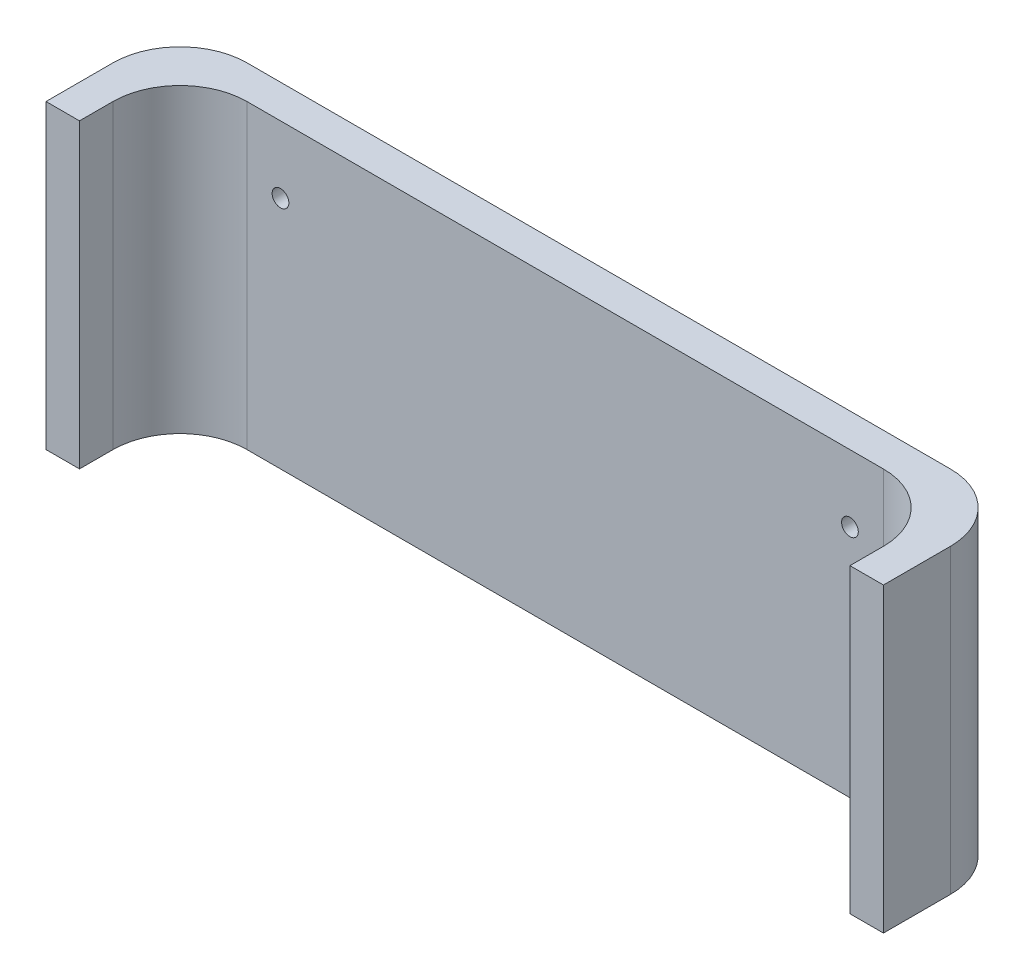
ISO-10303-21;
HEADER;
FILE_DESCRIPTION(('STEP AP214'),'2;1');
FILE_NAME('part.step','',(''),(''),'','','');
FILE_SCHEMA(('AUTOMOTIVE_DESIGN { 1 0 10303 214 1 1 1 1 }'));
ENDSEC;
DATA;
#1=APPLICATION_CONTEXT('core data for automotive mechanical design processes');
#2=APPLICATION_PROTOCOL_DEFINITION('international standard','automotive_design',2000,#1);
#3=PRODUCT_CONTEXT('',#1,'mechanical');
#4=PRODUCT('Part','Part','',(#3));
#5=PRODUCT_RELATED_PRODUCT_CATEGORY('part','',(#4));
#6=PRODUCT_DEFINITION_FORMATION('','',#4);
#7=PRODUCT_DEFINITION_CONTEXT('part definition',#1,'design');
#8=PRODUCT_DEFINITION('design','',#6,#7);
#9=PRODUCT_DEFINITION_SHAPE('','',#8);
#10=(LENGTH_UNIT() NAMED_UNIT(*) SI_UNIT(.MILLI.,.METRE.));
#11=(NAMED_UNIT(*) PLANE_ANGLE_UNIT() SI_UNIT($,.RADIAN.));
#12=(NAMED_UNIT(*) SI_UNIT($,.STERADIAN.) SOLID_ANGLE_UNIT());
#13=UNCERTAINTY_MEASURE_WITH_UNIT(LENGTH_MEASURE(1.E-05),#10,'distance_accuracy_value','');
#14=(GEOMETRIC_REPRESENTATION_CONTEXT(3) GLOBAL_UNCERTAINTY_ASSIGNED_CONTEXT((#13)) GLOBAL_UNIT_ASSIGNED_CONTEXT((#10,
#11,#12)) REPRESENTATION_CONTEXT('',''));
#15=CARTESIAN_POINT('',(0.,0.,0.));
#16=DIRECTION('',(0.,0.,1.));
#17=DIRECTION('',(1.,0.,0.));
#18=AXIS2_PLACEMENT_3D('',#15,#16,#17);
#19=CARTESIAN_POINT('',(0.,90.,0.));
#20=DIRECTION('',(0.,-1.,0.));
#21=DIRECTION('',(0.,0.,-1.));
#22=AXIS2_PLACEMENT_3D('',#19,#20,#21);
#23=PLANE('',#22);
#24=DIRECTION('',(0.,0.,1.));
#25=VECTOR('',#24,1.);
#26=CARTESIAN_POINT('',(-125.,90.,125.));
#27=LINE('',#26,#25);
#28=CARTESIAN_POINT('',(-125.,90.,-105.));
#29=VERTEX_POINT('',#28);
#30=CARTESIAN_POINT('',(-125.,90.,-85.));
#31=VERTEX_POINT('',#30);
#32=EDGE_CURVE('E163',#29,#31,#27,.T.);
#33=ORIENTED_EDGE('',*,*,#32,.T.);
#34=DIRECTION('',(-1.,0.,0.));
#35=VECTOR('',#34,1.);
#36=CARTESIAN_POINT('',(125.,90.,-85.));
#37=LINE('',#36,#35);
#38=CARTESIAN_POINT('',(-115.,90.,-85.));
#39=VERTEX_POINT('',#38);
#40=EDGE_CURVE('E134',#39,#31,#37,.T.);
#41=ORIENTED_EDGE('',*,*,#40,.F.);
#42=DIRECTION('',(0.,0.,1.));
#43=VECTOR('',#42,1.);
#44=CARTESIAN_POINT('',(-115.,90.,115.));
#45=LINE('',#44,#43);
#46=CARTESIAN_POINT('',(-115.,90.,-95.));
#47=VERTEX_POINT('',#46);
#48=EDGE_CURVE('E152',#47,#39,#45,.T.);
#49=ORIENTED_EDGE('',*,*,#48,.F.);
#50=CARTESIAN_POINT('',(-95.,90.,-95.));
#51=DIRECTION('',(0.,-1.,0.));
#52=DIRECTION('',(0.,0.,-1.));
#53=AXIS2_PLACEMENT_3D('',#50,#51,#52);
#54=CIRCLE('',#53,20.);
#55=CARTESIAN_POINT('',(-95.,90.,-115.));
#56=VERTEX_POINT('',#55);
#57=EDGE_CURVE('E47',#47,#56,#54,.T.);
#58=ORIENTED_EDGE('',*,*,#57,.T.);
#59=DIRECTION('',(-1.,0.,0.));
#60=VECTOR('',#59,1.);
#61=CARTESIAN_POINT('',(-115.,90.,-115.));
#62=LINE('',#61,#60);
#63=CARTESIAN_POINT('',(95.,90.,-115.));
#64=VERTEX_POINT('',#63);
#65=EDGE_CURVE('E160',#64,#56,#62,.T.);
#66=ORIENTED_EDGE('',*,*,#65,.F.);
#67=CARTESIAN_POINT('',(95.,90.,-95.));
#68=DIRECTION('',(0.,-1.,0.));
#69=DIRECTION('',(0.,0.,-1.));
#70=AXIS2_PLACEMENT_3D('',#67,#68,#69);
#71=CIRCLE('',#70,20.);
#72=CARTESIAN_POINT('',(115.,90.,-95.));
#73=VERTEX_POINT('',#72);
#74=EDGE_CURVE('E211',#64,#73,#71,.T.);
#75=ORIENTED_EDGE('',*,*,#74,.T.);
#76=DIRECTION('',(0.,0.,-1.));
#77=VECTOR('',#76,1.);
#78=CARTESIAN_POINT('',(115.,90.,115.));
#79=LINE('',#78,#77);
#80=CARTESIAN_POINT('',(115.,90.,-85.));
#81=VERTEX_POINT('',#80);
#82=EDGE_CURVE('E235',#81,#73,#79,.T.);
#83=ORIENTED_EDGE('',*,*,#82,.F.);
#84=CARTESIAN_POINT('',(125.,90.,-85.));
#85=VERTEX_POINT('',#84);
#86=EDGE_CURVE('E54',#85,#81,#37,.T.);
#87=ORIENTED_EDGE('',*,*,#86,.F.);
#88=DIRECTION('',(0.,0.,-1.));
#89=VECTOR('',#88,1.);
#90=CARTESIAN_POINT('',(125.,90.,125.));
#91=LINE('',#90,#89);
#92=CARTESIAN_POINT('',(125.,90.,-105.));
#93=VERTEX_POINT('',#92);
#94=EDGE_CURVE('E142',#85,#93,#91,.T.);
#95=ORIENTED_EDGE('',*,*,#94,.T.);
#96=CARTESIAN_POINT('',(105.,90.,-105.));
#97=DIRECTION('',(0.,-1.,0.));
#98=DIRECTION('',(0.,0.,-1.));
#99=AXIS2_PLACEMENT_3D('',#96,#97,#98);
#100=CIRCLE('',#99,20.);
#101=CARTESIAN_POINT('',(105.,90.,-125.));
#102=VERTEX_POINT('',#101);
#103=EDGE_CURVE('E195',#93,#102,#100,.F.);
#104=ORIENTED_EDGE('',*,*,#103,.T.);
#105=DIRECTION('',(-1.,0.,0.));
#106=VECTOR('',#105,1.);
#107=CARTESIAN_POINT('',(-125.,90.,-125.));
#108=LINE('',#107,#106);
#109=CARTESIAN_POINT('',(-105.,90.,-125.));
#110=VERTEX_POINT('',#109);
#111=EDGE_CURVE('E254',#102,#110,#108,.T.);
#112=ORIENTED_EDGE('',*,*,#111,.T.);
#113=CARTESIAN_POINT('',(-105.,90.,-105.));
#114=DIRECTION('',(0.,-1.,0.));
#115=DIRECTION('',(0.,0.,-1.));
#116=AXIS2_PLACEMENT_3D('',#113,#114,#115);
#117=CIRCLE('',#116,20.);
#118=EDGE_CURVE('E192',#110,#29,#117,.F.);
#119=ORIENTED_EDGE('',*,*,#118,.T.);
#120=EDGE_LOOP('',(#33,#41,#49,#58,#66,#75,#83,#87,#95,#104,#112,#119));
#121=FACE_BOUND('',#120,.T.);
#122=ADVANCED_FACE('F38',(#121),#23,.F.);
#123=CARTESIAN_POINT('',(0.,0.,0.));
#124=DIRECTION('',(0.,-1.,0.));
#125=DIRECTION('',(0.,0.,-1.));
#126=AXIS2_PLACEMENT_3D('',#123,#124,#125);
#127=PLANE('',#126);
#128=DIRECTION('',(-1.,0.,0.));
#129=VECTOR('',#128,1.);
#130=CARTESIAN_POINT('',(125.,0.,-85.));
#131=LINE('',#130,#129);
#132=CARTESIAN_POINT('',(-115.,0.,-85.));
#133=VERTEX_POINT('',#132);
#134=CARTESIAN_POINT('',(-125.,0.,-85.));
#135=VERTEX_POINT('',#134);
#136=EDGE_CURVE('E61',#133,#135,#131,.T.);
#137=ORIENTED_EDGE('',*,*,#136,.T.);
#138=DIRECTION('',(0.,0.,1.));
#139=VECTOR('',#138,1.);
#140=CARTESIAN_POINT('',(-125.,0.,125.));
#141=LINE('',#140,#139);
#142=CARTESIAN_POINT('',(-125.,0.,-105.));
#143=VERTEX_POINT('',#142);
#144=EDGE_CURVE('E157',#143,#135,#141,.T.);
#145=ORIENTED_EDGE('',*,*,#144,.F.);
#146=CARTESIAN_POINT('',(-105.,0.,-105.));
#147=DIRECTION('',(0.,-1.,0.));
#148=DIRECTION('',(0.,0.,-1.));
#149=AXIS2_PLACEMENT_3D('',#146,#147,#148);
#150=CIRCLE('',#149,20.);
#151=CARTESIAN_POINT('',(-105.,0.,-125.));
#152=VERTEX_POINT('',#151);
#153=EDGE_CURVE('E183',#143,#152,#150,.T.);
#154=ORIENTED_EDGE('',*,*,#153,.T.);
#155=DIRECTION('',(-1.,0.,0.));
#156=VECTOR('',#155,1.);
#157=CARTESIAN_POINT('',(-125.,0.,-125.));
#158=LINE('',#157,#156);
#159=CARTESIAN_POINT('',(105.,0.,-125.));
#160=VERTEX_POINT('',#159);
#161=EDGE_CURVE('E151',#160,#152,#158,.T.);
#162=ORIENTED_EDGE('',*,*,#161,.F.);
#163=CARTESIAN_POINT('',(105.,0.,-105.));
#164=DIRECTION('',(0.,-1.,0.));
#165=DIRECTION('',(0.,0.,-1.));
#166=AXIS2_PLACEMENT_3D('',#163,#164,#165);
#167=CIRCLE('',#166,20.);
#168=CARTESIAN_POINT('',(125.,0.,-105.));
#169=VERTEX_POINT('',#168);
#170=EDGE_CURVE('E148',#160,#169,#167,.T.);
#171=ORIENTED_EDGE('',*,*,#170,.T.);
#172=DIRECTION('',(0.,0.,-1.));
#173=VECTOR('',#172,1.);
#174=CARTESIAN_POINT('',(125.,0.,125.));
#175=LINE('',#174,#173);
#176=CARTESIAN_POINT('',(125.,0.,-85.));
#177=VERTEX_POINT('',#176);
#178=EDGE_CURVE('E140',#177,#169,#175,.T.);
#179=ORIENTED_EDGE('',*,*,#178,.F.);
#180=CARTESIAN_POINT('',(115.,0.,-85.));
#181=VERTEX_POINT('',#180);
#182=EDGE_CURVE('E125',#177,#181,#131,.T.);
#183=ORIENTED_EDGE('',*,*,#182,.T.);
#184=DIRECTION('',(0.,0.,-1.));
#185=VECTOR('',#184,1.);
#186=CARTESIAN_POINT('',(115.,0.,115.));
#187=LINE('',#186,#185);
#188=CARTESIAN_POINT('',(115.,0.,-95.));
#189=VERTEX_POINT('',#188);
#190=EDGE_CURVE('E249',#181,#189,#187,.T.);
#191=ORIENTED_EDGE('',*,*,#190,.T.);
#192=CARTESIAN_POINT('',(95.,0.,-95.));
#193=DIRECTION('',(0.,-1.,0.));
#194=DIRECTION('',(0.,0.,-1.));
#195=AXIS2_PLACEMENT_3D('',#192,#193,#194);
#196=CIRCLE('',#195,20.);
#197=CARTESIAN_POINT('',(95.,0.,-115.));
#198=VERTEX_POINT('',#197);
#199=EDGE_CURVE('E208',#189,#198,#196,.F.);
#200=ORIENTED_EDGE('',*,*,#199,.T.);
#201=DIRECTION('',(-1.,0.,0.));
#202=VECTOR('',#201,1.);
#203=CARTESIAN_POINT('',(-115.,0.,-115.));
#204=LINE('',#203,#202);
#205=CARTESIAN_POINT('',(-95.,0.,-115.));
#206=VERTEX_POINT('',#205);
#207=EDGE_CURVE('E241',#198,#206,#204,.T.);
#208=ORIENTED_EDGE('',*,*,#207,.T.);
#209=CARTESIAN_POINT('',(-95.,0.,-95.));
#210=DIRECTION('',(0.,-1.,0.));
#211=DIRECTION('',(0.,0.,-1.));
#212=AXIS2_PLACEMENT_3D('',#209,#210,#211);
#213=CIRCLE('',#212,20.);
#214=CARTESIAN_POINT('',(-115.,0.,-95.));
#215=VERTEX_POINT('',#214);
#216=EDGE_CURVE('E215',#206,#215,#213,.F.);
#217=ORIENTED_EDGE('',*,*,#216,.T.);
#218=DIRECTION('',(0.,0.,1.));
#219=VECTOR('',#218,1.);
#220=CARTESIAN_POINT('',(-115.,0.,115.));
#221=LINE('',#220,#219);
#222=EDGE_CURVE('E240',#215,#133,#221,.T.);
#223=ORIENTED_EDGE('',*,*,#222,.T.);
#224=EDGE_LOOP('',(#137,#145,#154,#162,#171,#179,#183,#191,#200,#208,#217,#223));
#225=FACE_BOUND('',#224,.T.);
#226=ADVANCED_FACE('F146',(#225),#127,.T.);
#227=CARTESIAN_POINT('',(125.,90.,125.));
#228=DIRECTION('',(-1.,0.,0.));
#229=DIRECTION('',(0.,0.,1.));
#230=AXIS2_PLACEMENT_3D('',#227,#228,#229);
#231=PLANE('',#230);
#232=ORIENTED_EDGE('',*,*,#94,.F.);
#233=DIRECTION('',(0.,-1.,0.));
#234=VECTOR('',#233,1.);
#235=CARTESIAN_POINT('',(125.,90.,-85.));
#236=LINE('',#235,#234);
#237=EDGE_CURVE('E128',#85,#177,#236,.T.);
#238=ORIENTED_EDGE('',*,*,#237,.T.);
#239=ORIENTED_EDGE('',*,*,#178,.T.);
#240=DIRECTION('',(0.,-1.,0.));
#241=VECTOR('',#240,1.);
#242=CARTESIAN_POINT('',(125.,90.,-105.));
#243=LINE('',#242,#241);
#244=EDGE_CURVE('E198',#169,#93,#243,.F.);
#245=ORIENTED_EDGE('',*,*,#244,.T.);
#246=EDGE_LOOP('',(#232,#238,#239,#245));
#247=FACE_BOUND('',#246,.T.);
#248=ADVANCED_FACE('F138',(#247),#231,.F.);
#249=CARTESIAN_POINT('',(-125.,90.,-125.));
#250=DIRECTION('',(0.,0.,1.));
#251=DIRECTION('',(1.,0.,0.));
#252=AXIS2_PLACEMENT_3D('',#249,#250,#251);
#253=PLANE('',#252);
#254=CARTESIAN_POINT('',(-85.,70.,-125.));
#255=DIRECTION('',(0.,0.,-1.));
#256=DIRECTION('',(-1.,0.,0.));
#257=AXIS2_PLACEMENT_3D('',#254,#255,#256);
#258=CIRCLE('',#257,2.50000000000002);
#259=CARTESIAN_POINT('',(-87.5,70.,-125.));
#260=VERTEX_POINT('',#259);
#261=EDGE_CURVE('E420',#260,#260,#258,.T.);
#262=ORIENTED_EDGE('',*,*,#261,.F.);
#263=EDGE_LOOP('',(#262));
#264=FACE_BOUND('',#263,.T.);
#265=CARTESIAN_POINT('',(85.,70.,-125.));
#266=DIRECTION('',(0.,0.,-1.));
#267=DIRECTION('',(-1.,0.,0.));
#268=AXIS2_PLACEMENT_3D('',#265,#266,#267);
#269=CIRCLE('',#268,2.50000000000002);
#270=CARTESIAN_POINT('',(82.5,70.,-125.));
#271=VERTEX_POINT('',#270);
#272=EDGE_CURVE('E428',#271,#271,#269,.T.);
#273=ORIENTED_EDGE('',*,*,#272,.F.);
#274=EDGE_LOOP('',(#273));
#275=FACE_BOUND('',#274,.T.);
#276=ORIENTED_EDGE('',*,*,#111,.F.);
#277=DIRECTION('',(0.,-1.,0.));
#278=VECTOR('',#277,1.);
#279=CARTESIAN_POINT('',(105.,90.,-125.));
#280=LINE('',#279,#278);
#281=EDGE_CURVE('E204',#102,#160,#280,.T.);
#282=ORIENTED_EDGE('',*,*,#281,.T.);
#283=ORIENTED_EDGE('',*,*,#161,.T.);
#284=DIRECTION('',(0.,-1.,0.));
#285=VECTOR('',#284,1.);
#286=CARTESIAN_POINT('',(-105.,90.,-125.));
#287=LINE('',#286,#285);
#288=EDGE_CURVE('E201',#152,#110,#287,.F.);
#289=ORIENTED_EDGE('',*,*,#288,.T.);
#290=EDGE_LOOP('',(#276,#282,#283,#289));
#291=FACE_BOUND('',#290,.T.);
#292=ADVANCED_FACE('F269',(#264,#275,#291),#253,.F.);
#293=CARTESIAN_POINT('',(-125.,90.,125.));
#294=DIRECTION('',(1.,0.,0.));
#295=DIRECTION('',(0.,0.,-1.));
#296=AXIS2_PLACEMENT_3D('',#293,#294,#295);
#297=PLANE('',#296);
#298=ORIENTED_EDGE('',*,*,#144,.T.);
#299=DIRECTION('',(0.,-1.,0.));
#300=VECTOR('',#299,1.);
#301=CARTESIAN_POINT('',(-125.,90.,-85.));
#302=LINE('',#301,#300);
#303=EDGE_CURVE('E144',#31,#135,#302,.T.);
#304=ORIENTED_EDGE('',*,*,#303,.F.);
#305=ORIENTED_EDGE('',*,*,#32,.F.);
#306=DIRECTION('',(0.,-1.,0.));
#307=VECTOR('',#306,1.);
#308=CARTESIAN_POINT('',(-125.,90.,-105.));
#309=LINE('',#308,#307);
#310=EDGE_CURVE('E188',#29,#143,#309,.T.);
#311=ORIENTED_EDGE('',*,*,#310,.T.);
#312=EDGE_LOOP('',(#298,#304,#305,#311));
#313=FACE_BOUND('',#312,.T.);
#314=ADVANCED_FACE('F264',(#313),#297,.F.);
#315=CARTESIAN_POINT('',(115.,90.,115.));
#316=DIRECTION('',(-1.,0.,0.));
#317=DIRECTION('',(0.,0.,1.));
#318=AXIS2_PLACEMENT_3D('',#315,#316,#317);
#319=PLANE('',#318);
#320=DIRECTION('',(0.,-1.,0.));
#321=VECTOR('',#320,1.);
#322=CARTESIAN_POINT('',(115.,90.,-85.));
#323=LINE('',#322,#321);
#324=EDGE_CURVE('E129',#81,#181,#323,.T.);
#325=ORIENTED_EDGE('',*,*,#324,.F.);
#326=ORIENTED_EDGE('',*,*,#82,.T.);
#327=DIRECTION('',(0.,-1.,0.));
#328=VECTOR('',#327,1.);
#329=CARTESIAN_POINT('',(115.,0.,-95.));
#330=LINE('',#329,#328);
#331=EDGE_CURVE('E172',#73,#189,#330,.T.);
#332=ORIENTED_EDGE('',*,*,#331,.T.);
#333=ORIENTED_EDGE('',*,*,#190,.F.);
#334=EDGE_LOOP('',(#325,#326,#332,#333));
#335=FACE_BOUND('',#334,.T.);
#336=ADVANCED_FACE('F287',(#335),#319,.T.);
#337=CARTESIAN_POINT('',(-115.,90.,-115.));
#338=DIRECTION('',(0.,0.,1.));
#339=DIRECTION('',(1.,0.,0.));
#340=AXIS2_PLACEMENT_3D('',#337,#338,#339);
#341=PLANE('',#340);
#342=CARTESIAN_POINT('',(-85.,70.,-115.));
#343=DIRECTION('',(0.,0.,-1.));
#344=DIRECTION('',(-1.,0.,0.));
#345=AXIS2_PLACEMENT_3D('',#342,#343,#344);
#346=CIRCLE('',#345,2.50000000000002);
#347=CARTESIAN_POINT('',(-87.5,70.,-115.));
#348=VERTEX_POINT('',#347);
#349=EDGE_CURVE('E417',#348,#348,#346,.T.);
#350=ORIENTED_EDGE('',*,*,#349,.T.);
#351=EDGE_LOOP('',(#350));
#352=FACE_BOUND('',#351,.T.);
#353=CARTESIAN_POINT('',(85.,70.,-115.));
#354=DIRECTION('',(0.,0.,-1.));
#355=DIRECTION('',(-1.,0.,0.));
#356=AXIS2_PLACEMENT_3D('',#353,#354,#355);
#357=CIRCLE('',#356,2.50000000000002);
#358=CARTESIAN_POINT('',(82.5,70.,-115.));
#359=VERTEX_POINT('',#358);
#360=EDGE_CURVE('E422',#359,#359,#357,.T.);
#361=ORIENTED_EDGE('',*,*,#360,.T.);
#362=EDGE_LOOP('',(#361));
#363=FACE_BOUND('',#362,.T.);
#364=ORIENTED_EDGE('',*,*,#207,.F.);
#365=DIRECTION('',(0.,-1.,0.));
#366=VECTOR('',#365,1.);
#367=CARTESIAN_POINT('',(95.,90.,-115.));
#368=LINE('',#367,#366);
#369=EDGE_CURVE('E180',#198,#64,#368,.F.);
#370=ORIENTED_EDGE('',*,*,#369,.T.);
#371=ORIENTED_EDGE('',*,*,#65,.T.);
#372=DIRECTION('',(0.,-1.,0.));
#373=VECTOR('',#372,1.);
#374=CARTESIAN_POINT('',(-95.,0.,-115.));
#375=LINE('',#374,#373);
#376=EDGE_CURVE('E176',#56,#206,#375,.T.);
#377=ORIENTED_EDGE('',*,*,#376,.T.);
#378=EDGE_LOOP('',(#364,#370,#371,#377));
#379=FACE_BOUND('',#378,.T.);
#380=ADVANCED_FACE('F231',(#352,#363,#379),#341,.T.);
#381=CARTESIAN_POINT('',(-115.,90.,115.));
#382=DIRECTION('',(1.,0.,0.));
#383=DIRECTION('',(0.,0.,-1.));
#384=AXIS2_PLACEMENT_3D('',#381,#382,#383);
#385=PLANE('',#384);
#386=DIRECTION('',(0.,1.,0.));
#387=VECTOR('',#386,1.);
#388=CARTESIAN_POINT('',(-115.,90.,-85.));
#389=LINE('',#388,#387);
#390=EDGE_CURVE('E11',#133,#39,#389,.T.);
#391=ORIENTED_EDGE('',*,*,#390,.F.);
#392=ORIENTED_EDGE('',*,*,#222,.F.);
#393=DIRECTION('',(0.,-1.,0.));
#394=VECTOR('',#393,1.);
#395=CARTESIAN_POINT('',(-115.,90.,-95.));
#396=LINE('',#395,#394);
#397=EDGE_CURVE('E169',#215,#47,#396,.F.);
#398=ORIENTED_EDGE('',*,*,#397,.T.);
#399=ORIENTED_EDGE('',*,*,#48,.T.);
#400=EDGE_LOOP('',(#391,#392,#398,#399));
#401=FACE_BOUND('',#400,.T.);
#402=ADVANCED_FACE('F243',(#401),#385,.T.);
#403=CARTESIAN_POINT('',(95.,90.,-95.));
#404=DIRECTION('',(0.,1.,0.));
#405=DIRECTION('',(0.,0.,1.));
#406=AXIS2_PLACEMENT_3D('',#403,#404,#405);
#407=CYLINDRICAL_SURFACE('',#406,20.);
#408=ORIENTED_EDGE('',*,*,#74,.F.);
#409=ORIENTED_EDGE('',*,*,#369,.F.);
#410=ORIENTED_EDGE('',*,*,#199,.F.);
#411=ORIENTED_EDGE('',*,*,#331,.F.);
#412=EDGE_LOOP('',(#408,#409,#410,#411));
#413=FACE_BOUND('',#412,.T.);
#414=ADVANCED_FACE('F286',(#413),#407,.F.);
#415=CARTESIAN_POINT('',(-95.,90.,-95.));
#416=DIRECTION('',(0.,1.,0.));
#417=DIRECTION('',(0.,0.,1.));
#418=AXIS2_PLACEMENT_3D('',#415,#416,#417);
#419=CYLINDRICAL_SURFACE('',#418,20.);
#420=ORIENTED_EDGE('',*,*,#57,.F.);
#421=ORIENTED_EDGE('',*,*,#397,.F.);
#422=ORIENTED_EDGE('',*,*,#216,.F.);
#423=ORIENTED_EDGE('',*,*,#376,.F.);
#424=EDGE_LOOP('',(#420,#421,#422,#423));
#425=FACE_BOUND('',#424,.T.);
#426=ADVANCED_FACE('F237',(#425),#419,.F.);
#427=CARTESIAN_POINT('',(105.,90.,-105.));
#428=DIRECTION('',(0.,-1.,0.));
#429=DIRECTION('',(0.,0.,-1.));
#430=AXIS2_PLACEMENT_3D('',#427,#428,#429);
#431=CYLINDRICAL_SURFACE('',#430,20.);
#432=ORIENTED_EDGE('',*,*,#103,.F.);
#433=ORIENTED_EDGE('',*,*,#244,.F.);
#434=ORIENTED_EDGE('',*,*,#170,.F.);
#435=ORIENTED_EDGE('',*,*,#281,.F.);
#436=EDGE_LOOP('',(#432,#433,#434,#435));
#437=FACE_BOUND('',#436,.T.);
#438=ADVANCED_FACE('F273',(#437),#431,.T.);
#439=CARTESIAN_POINT('',(-105.,90.,-105.));
#440=DIRECTION('',(0.,-1.,0.));
#441=DIRECTION('',(0.,0.,-1.));
#442=AXIS2_PLACEMENT_3D('',#439,#440,#441);
#443=CYLINDRICAL_SURFACE('',#442,20.);
#444=ORIENTED_EDGE('',*,*,#118,.F.);
#445=ORIENTED_EDGE('',*,*,#288,.F.);
#446=ORIENTED_EDGE('',*,*,#153,.F.);
#447=ORIENTED_EDGE('',*,*,#310,.F.);
#448=EDGE_LOOP('',(#444,#445,#446,#447));
#449=FACE_BOUND('',#448,.T.);
#450=ADVANCED_FACE('F40',(#449),#443,.T.);
#451=CARTESIAN_POINT('',(125.,90.,-85.));
#452=DIRECTION('',(0.,0.,-1.));
#453=DIRECTION('',(-1.,0.,0.));
#454=AXIS2_PLACEMENT_3D('',#451,#452,#453);
#455=PLANE('',#454);
#456=ORIENTED_EDGE('',*,*,#390,.T.);
#457=ORIENTED_EDGE('',*,*,#40,.T.);
#458=ORIENTED_EDGE('',*,*,#303,.T.);
#459=ORIENTED_EDGE('',*,*,#136,.F.);
#460=EDGE_LOOP('',(#456,#457,#458,#459));
#461=FACE_BOUND('',#460,.T.);
#462=ADVANCED_FACE('F317',(#461),#455,.F.);
#463=ORIENTED_EDGE('',*,*,#324,.T.);
#464=ORIENTED_EDGE('',*,*,#182,.F.);
#465=ORIENTED_EDGE('',*,*,#237,.F.);
#466=ORIENTED_EDGE('',*,*,#86,.T.);
#467=EDGE_LOOP('',(#463,#464,#465,#466));
#468=FACE_BOUND('',#467,.T.);
#469=ADVANCED_FACE('F127',(#468),#455,.F.);
#470=CARTESIAN_POINT('',(85.,70.,-115.));
#471=DIRECTION('',(0.,0.,-1.));
#472=DIRECTION('',(-1.,0.,0.));
#473=AXIS2_PLACEMENT_3D('',#470,#471,#472);
#474=CYLINDRICAL_SURFACE('',#473,2.50000000000002);
#475=ORIENTED_EDGE('',*,*,#360,.F.);
#476=EDGE_LOOP('',(#475));
#477=FACE_BOUND('',#476,.T.);
#478=ORIENTED_EDGE('',*,*,#272,.T.);
#479=EDGE_LOOP('',(#478));
#480=FACE_BOUND('',#479,.T.);
#481=ADVANCED_FACE('F325',(#477,#480),#474,.F.);
#482=CARTESIAN_POINT('',(-85.,70.,-115.));
#483=DIRECTION('',(0.,0.,-1.));
#484=DIRECTION('',(-1.,0.,0.));
#485=AXIS2_PLACEMENT_3D('',#482,#483,#484);
#486=CYLINDRICAL_SURFACE('',#485,2.50000000000002);
#487=ORIENTED_EDGE('',*,*,#349,.F.);
#488=EDGE_LOOP('',(#487));
#489=FACE_BOUND('',#488,.T.);
#490=ORIENTED_EDGE('',*,*,#261,.T.);
#491=EDGE_LOOP('',(#490));
#492=FACE_BOUND('',#491,.T.);
#493=ADVANCED_FACE('F402',(#489,#492),#486,.F.);
#494=CLOSED_SHELL('',(#122,#226,#248,#292,#314,#336,#380,#402,#414,#426,#438,#450,#462,#469,
#481,#493));
#495=MANIFOLD_SOLID_BREP('B2',#494);
#496=ADVANCED_BREP_SHAPE_REPRESENTATION('',(#18,#495),#14);
#497=SHAPE_DEFINITION_REPRESENTATION(#9,#496);
ENDSEC;
END-ISO-10303-21;
